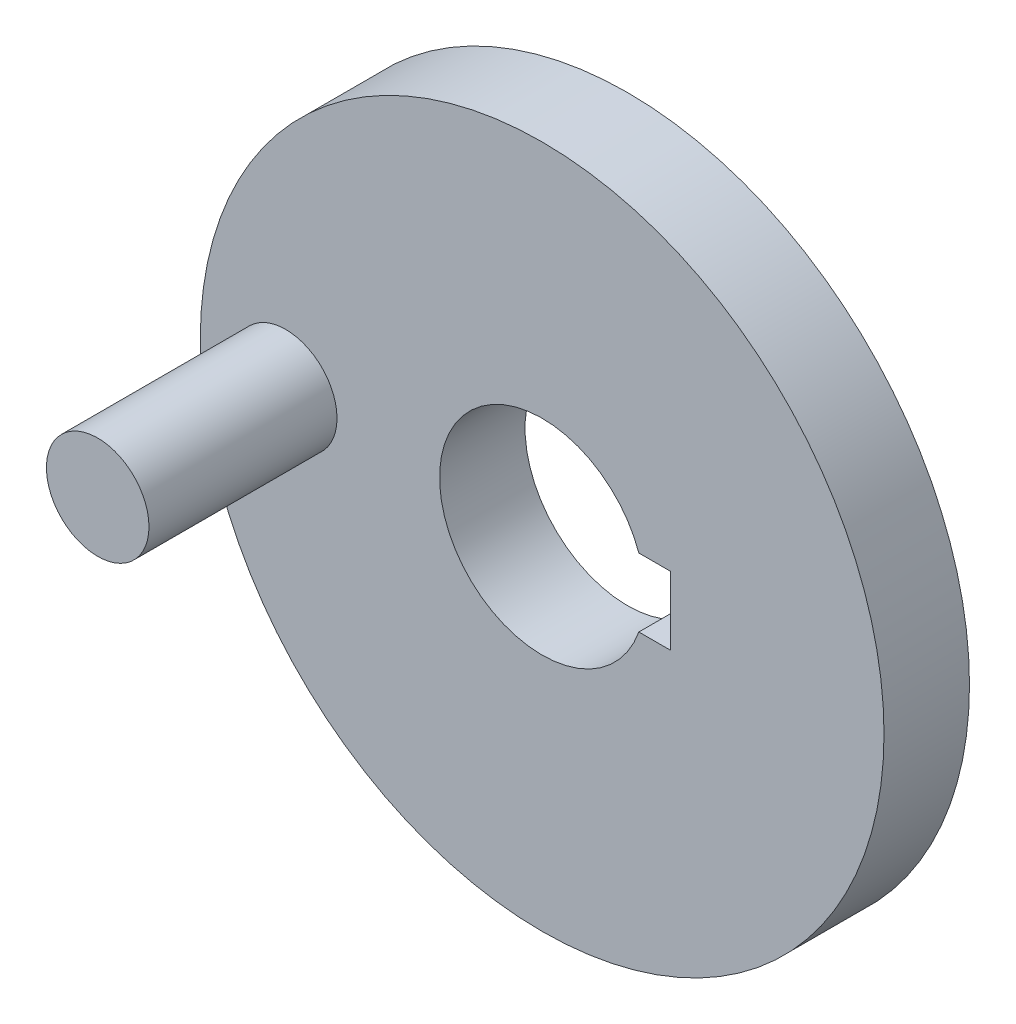
ISO-10303-21;
HEADER;
FILE_DESCRIPTION(('STEP AP214'),'2;1');
FILE_NAME('part.step','',(''),(''),'','','');
FILE_SCHEMA(('AUTOMOTIVE_DESIGN { 1 0 10303 214 1 1 1 1 }'));
ENDSEC;
DATA;
#1=APPLICATION_CONTEXT('core data for automotive mechanical design processes');
#2=APPLICATION_PROTOCOL_DEFINITION('international standard','automotive_design',2000,#1);
#3=PRODUCT_CONTEXT('',#1,'mechanical');
#4=PRODUCT('Part','Part','',(#3));
#5=PRODUCT_RELATED_PRODUCT_CATEGORY('part','',(#4));
#6=PRODUCT_DEFINITION_FORMATION('','',#4);
#7=PRODUCT_DEFINITION_CONTEXT('part definition',#1,'design');
#8=PRODUCT_DEFINITION('design','',#6,#7);
#9=PRODUCT_DEFINITION_SHAPE('','',#8);
#10=(LENGTH_UNIT() NAMED_UNIT(*) SI_UNIT(.MILLI.,.METRE.));
#11=(NAMED_UNIT(*) PLANE_ANGLE_UNIT() SI_UNIT($,.RADIAN.));
#12=(NAMED_UNIT(*) SI_UNIT($,.STERADIAN.) SOLID_ANGLE_UNIT());
#13=UNCERTAINTY_MEASURE_WITH_UNIT(LENGTH_MEASURE(1.E-05),#10,'distance_accuracy_value','');
#14=(GEOMETRIC_REPRESENTATION_CONTEXT(3) GLOBAL_UNCERTAINTY_ASSIGNED_CONTEXT((#13)) GLOBAL_UNIT_ASSIGNED_CONTEXT((#10,
#11,#12)) REPRESENTATION_CONTEXT('',''));
#15=CARTESIAN_POINT('',(0.,0.,0.));
#16=DIRECTION('',(0.,0.,1.));
#17=DIRECTION('',(1.,0.,0.));
#18=AXIS2_PLACEMENT_3D('',#15,#16,#17);
#19=CARTESIAN_POINT('',(0.,0.,5.));
#20=DIRECTION('',(0.,0.,-1.));
#21=DIRECTION('',(-1.,0.,0.));
#22=AXIS2_PLACEMENT_3D('',#19,#20,#21);
#23=CYLINDRICAL_SURFACE('',#22,20.);
#24=CARTESIAN_POINT('',(0.,0.,5.));
#25=DIRECTION('',(0.,0.,1.));
#26=DIRECTION('',(1.,0.,0.));
#27=AXIS2_PLACEMENT_3D('',#24,#25,#26);
#28=CIRCLE('',#27,20.);
#29=CARTESIAN_POINT('',(20.,0.,5.));
#30=VERTEX_POINT('',#29);
#31=EDGE_CURVE('E11',#30,#30,#28,.T.);
#32=ORIENTED_EDGE('',*,*,#31,.F.);
#33=EDGE_LOOP('',(#32));
#34=FACE_BOUND('',#33,.T.);
#35=CARTESIAN_POINT('',(0.,0.,0.));
#36=DIRECTION('',(0.,0.,1.));
#37=DIRECTION('',(1.,0.,0.));
#38=AXIS2_PLACEMENT_3D('',#35,#36,#37);
#39=CIRCLE('',#38,20.);
#40=CARTESIAN_POINT('',(20.,0.,0.));
#41=VERTEX_POINT('',#40);
#42=EDGE_CURVE('E35',#41,#41,#39,.T.);
#43=ORIENTED_EDGE('',*,*,#42,.T.);
#44=EDGE_LOOP('',(#43));
#45=FACE_BOUND('',#44,.T.);
#46=ADVANCED_FACE('F32',(#34,#45),#23,.T.);
#47=CARTESIAN_POINT('',(0.,0.,5.));
#48=DIRECTION('',(0.,0.,1.));
#49=DIRECTION('',(1.,0.,0.));
#50=AXIS2_PLACEMENT_3D('',#47,#48,#49);
#51=PLANE('',#50);
#52=CARTESIAN_POINT('',(0.,0.,5.));
#53=DIRECTION('',(0.,0.,1.));
#54=DIRECTION('',(1.,0.,0.));
#55=AXIS2_PLACEMENT_3D('',#52,#53,#54);
#56=CIRCLE('',#55,6.);
#57=CARTESIAN_POINT('',(5.65685424949238,2.,5.));
#58=VERTEX_POINT('',#57);
#59=CARTESIAN_POINT('',(5.65685424949238,-2.,5.));
#60=VERTEX_POINT('',#59);
#61=EDGE_CURVE('E46',#58,#60,#56,.T.);
#62=ORIENTED_EDGE('',*,*,#61,.F.);
#63=DIRECTION('',(-1.,0.,0.));
#64=VECTOR('',#63,1.);
#65=CARTESIAN_POINT('',(5.65685424949238,2.,5.));
#66=LINE('',#65,#64);
#67=CARTESIAN_POINT('',(7.5,2.,5.));
#68=VERTEX_POINT('',#67);
#69=EDGE_CURVE('E90',#68,#58,#66,.T.);
#70=ORIENTED_EDGE('',*,*,#69,.F.);
#71=DIRECTION('',(0.,1.,0.));
#72=VECTOR('',#71,1.);
#73=CARTESIAN_POINT('',(7.5,2.,5.));
#74=LINE('',#73,#72);
#75=CARTESIAN_POINT('',(7.5,-2.,5.));
#76=VERTEX_POINT('',#75);
#77=EDGE_CURVE('E93',#76,#68,#74,.T.);
#78=ORIENTED_EDGE('',*,*,#77,.F.);
#79=DIRECTION('',(1.,0.,0.));
#80=VECTOR('',#79,1.);
#81=CARTESIAN_POINT('',(7.5,-2.,5.));
#82=LINE('',#81,#80);
#83=EDGE_CURVE('E99',#60,#76,#82,.T.);
#84=ORIENTED_EDGE('',*,*,#83,.F.);
#85=EDGE_LOOP('',(#62,#70,#78,#84));
#86=FACE_BOUND('',#85,.T.);
#87=CARTESIAN_POINT('',(-15.,0.,5.));
#88=DIRECTION('',(0.,0.,1.));
#89=DIRECTION('',(1.,0.,0.));
#90=AXIS2_PLACEMENT_3D('',#87,#88,#89);
#91=CIRCLE('',#90,3.);
#92=CARTESIAN_POINT('',(-12.,0.,5.));
#93=VERTEX_POINT('',#92);
#94=EDGE_CURVE('E105',#93,#93,#91,.T.);
#95=ORIENTED_EDGE('',*,*,#94,.F.);
#96=EDGE_LOOP('',(#95));
#97=FACE_BOUND('',#96,.T.);
#98=ORIENTED_EDGE('',*,*,#31,.T.);
#99=EDGE_LOOP('',(#98));
#100=FACE_BOUND('',#99,.T.);
#101=ADVANCED_FACE('F117',(#86,#97,#100),#51,.T.);
#102=CARTESIAN_POINT('',(0.,0.,0.));
#103=DIRECTION('',(0.,0.,1.));
#104=DIRECTION('',(1.,0.,0.));
#105=AXIS2_PLACEMENT_3D('',#102,#103,#104);
#106=PLANE('',#105);
#107=DIRECTION('',(-1.,0.,0.));
#108=VECTOR('',#107,1.);
#109=CARTESIAN_POINT('',(5.65685424949238,2.,0.));
#110=LINE('',#109,#108);
#111=CARTESIAN_POINT('',(7.5,2.,0.));
#112=VERTEX_POINT('',#111);
#113=CARTESIAN_POINT('',(5.65685424949238,2.,0.));
#114=VERTEX_POINT('',#113);
#115=EDGE_CURVE('E80',#112,#114,#110,.T.);
#116=ORIENTED_EDGE('',*,*,#115,.T.);
#117=CARTESIAN_POINT('',(0.,0.,0.));
#118=DIRECTION('',(0.,0.,1.));
#119=DIRECTION('',(1.,0.,0.));
#120=AXIS2_PLACEMENT_3D('',#117,#118,#119);
#121=CIRCLE('',#120,6.);
#122=CARTESIAN_POINT('',(5.65685424949238,-2.,0.));
#123=VERTEX_POINT('',#122);
#124=EDGE_CURVE('E74',#114,#123,#121,.T.);
#125=ORIENTED_EDGE('',*,*,#124,.T.);
#126=DIRECTION('',(1.,0.,0.));
#127=VECTOR('',#126,1.);
#128=CARTESIAN_POINT('',(7.5,-2.,0.));
#129=LINE('',#128,#127);
#130=CARTESIAN_POINT('',(7.5,-2.,0.));
#131=VERTEX_POINT('',#130);
#132=EDGE_CURVE('E83',#123,#131,#129,.T.);
#133=ORIENTED_EDGE('',*,*,#132,.T.);
#134=DIRECTION('',(0.,1.,0.));
#135=VECTOR('',#134,1.);
#136=CARTESIAN_POINT('',(7.5,2.,0.));
#137=LINE('',#136,#135);
#138=EDGE_CURVE('E54',#131,#112,#137,.T.);
#139=ORIENTED_EDGE('',*,*,#138,.T.);
#140=EDGE_LOOP('',(#116,#125,#133,#139));
#141=FACE_BOUND('',#140,.T.);
#142=ORIENTED_EDGE('',*,*,#42,.F.);
#143=EDGE_LOOP('',(#142));
#144=FACE_BOUND('',#143,.T.);
#145=ADVANCED_FACE('F87',(#141,#144),#106,.F.);
#146=CARTESIAN_POINT('',(-15.,0.,16.));
#147=DIRECTION('',(0.,0.,-1.));
#148=DIRECTION('',(-1.,0.,0.));
#149=AXIS2_PLACEMENT_3D('',#146,#147,#148);
#150=CYLINDRICAL_SURFACE('',#149,3.);
#151=CARTESIAN_POINT('',(-15.,0.,16.));
#152=DIRECTION('',(0.,0.,1.));
#153=DIRECTION('',(1.,0.,0.));
#154=AXIS2_PLACEMENT_3D('',#151,#152,#153);
#155=CIRCLE('',#154,3.);
#156=CARTESIAN_POINT('',(-12.,0.,16.));
#157=VERTEX_POINT('',#156);
#158=EDGE_CURVE('E109',#157,#157,#155,.T.);
#159=ORIENTED_EDGE('',*,*,#158,.F.);
#160=EDGE_LOOP('',(#159));
#161=FACE_BOUND('',#160,.T.);
#162=ORIENTED_EDGE('',*,*,#94,.T.);
#163=EDGE_LOOP('',(#162));
#164=FACE_BOUND('',#163,.T.);
#165=ADVANCED_FACE('F115',(#161,#164),#150,.T.);
#166=CARTESIAN_POINT('',(-15.,0.,16.));
#167=DIRECTION('',(0.,0.,1.));
#168=DIRECTION('',(1.,0.,0.));
#169=AXIS2_PLACEMENT_3D('',#166,#167,#168);
#170=PLANE('',#169);
#171=ORIENTED_EDGE('',*,*,#158,.T.);
#172=EDGE_LOOP('',(#171));
#173=FACE_BOUND('',#172,.T.);
#174=ADVANCED_FACE('F132',(#173),#170,.T.);
#175=CARTESIAN_POINT('',(0.,0.,0.));
#176=DIRECTION('',(0.,0.,1.));
#177=DIRECTION('',(1.,0.,0.));
#178=AXIS2_PLACEMENT_3D('',#175,#176,#177);
#179=CYLINDRICAL_SURFACE('',#178,6.);
#180=ORIENTED_EDGE('',*,*,#61,.T.);
#181=DIRECTION('',(0.,0.,1.));
#182=VECTOR('',#181,1.);
#183=CARTESIAN_POINT('',(5.65685424949238,-2.,0.));
#184=LINE('',#183,#182);
#185=EDGE_CURVE('E70',#123,#60,#184,.T.);
#186=ORIENTED_EDGE('',*,*,#185,.F.);
#187=ORIENTED_EDGE('',*,*,#124,.F.);
#188=DIRECTION('',(0.,0.,1.));
#189=VECTOR('',#188,1.);
#190=CARTESIAN_POINT('',(5.65685424949238,2.,0.));
#191=LINE('',#190,#189);
#192=EDGE_CURVE('E103',#114,#58,#191,.T.);
#193=ORIENTED_EDGE('',*,*,#192,.T.);
#194=EDGE_LOOP('',(#180,#186,#187,#193));
#195=FACE_BOUND('',#194,.T.);
#196=ADVANCED_FACE('F72',(#195),#179,.F.);
#197=CARTESIAN_POINT('',(5.65685424949238,2.,0.));
#198=DIRECTION('',(0.,1.,0.));
#199=DIRECTION('',(0.,0.,1.));
#200=AXIS2_PLACEMENT_3D('',#197,#198,#199);
#201=PLANE('',#200);
#202=ORIENTED_EDGE('',*,*,#69,.T.);
#203=ORIENTED_EDGE('',*,*,#192,.F.);
#204=ORIENTED_EDGE('',*,*,#115,.F.);
#205=DIRECTION('',(0.,0.,1.));
#206=VECTOR('',#205,1.);
#207=CARTESIAN_POINT('',(7.5,2.,0.));
#208=LINE('',#207,#206);
#209=EDGE_CURVE('E106',#112,#68,#208,.T.);
#210=ORIENTED_EDGE('',*,*,#209,.T.);
#211=EDGE_LOOP('',(#202,#203,#204,#210));
#212=FACE_BOUND('',#211,.T.);
#213=ADVANCED_FACE('F141',(#212),#201,.F.);
#214=CARTESIAN_POINT('',(7.5,2.,0.));
#215=DIRECTION('',(1.,0.,0.));
#216=DIRECTION('',(0.,0.,-1.));
#217=AXIS2_PLACEMENT_3D('',#214,#215,#216);
#218=PLANE('',#217);
#219=ORIENTED_EDGE('',*,*,#77,.T.);
#220=ORIENTED_EDGE('',*,*,#209,.F.);
#221=ORIENTED_EDGE('',*,*,#138,.F.);
#222=DIRECTION('',(0.,0.,1.));
#223=VECTOR('',#222,1.);
#224=CARTESIAN_POINT('',(7.5,-2.,0.));
#225=LINE('',#224,#223);
#226=EDGE_CURVE('E79',#131,#76,#225,.T.);
#227=ORIENTED_EDGE('',*,*,#226,.T.);
#228=EDGE_LOOP('',(#219,#220,#221,#227));
#229=FACE_BOUND('',#228,.T.);
#230=ADVANCED_FACE('F144',(#229),#218,.F.);
#231=CARTESIAN_POINT('',(7.5,-2.,0.));
#232=DIRECTION('',(0.,-1.,0.));
#233=DIRECTION('',(0.,0.,-1.));
#234=AXIS2_PLACEMENT_3D('',#231,#232,#233);
#235=PLANE('',#234);
#236=ORIENTED_EDGE('',*,*,#83,.T.);
#237=ORIENTED_EDGE('',*,*,#226,.F.);
#238=ORIENTED_EDGE('',*,*,#132,.F.);
#239=ORIENTED_EDGE('',*,*,#185,.T.);
#240=EDGE_LOOP('',(#236,#237,#238,#239));
#241=FACE_BOUND('',#240,.T.);
#242=ADVANCED_FACE('F84',(#241),#235,.F.);
#243=CLOSED_SHELL('',(#46,#101,#145,#165,#174,#196,#213,#230,#242));
#244=MANIFOLD_SOLID_BREP('B2',#243);
#245=ADVANCED_BREP_SHAPE_REPRESENTATION('',(#18,#244),#14);
#246=SHAPE_DEFINITION_REPRESENTATION(#9,#245);
ENDSEC;
END-ISO-10303-21;
